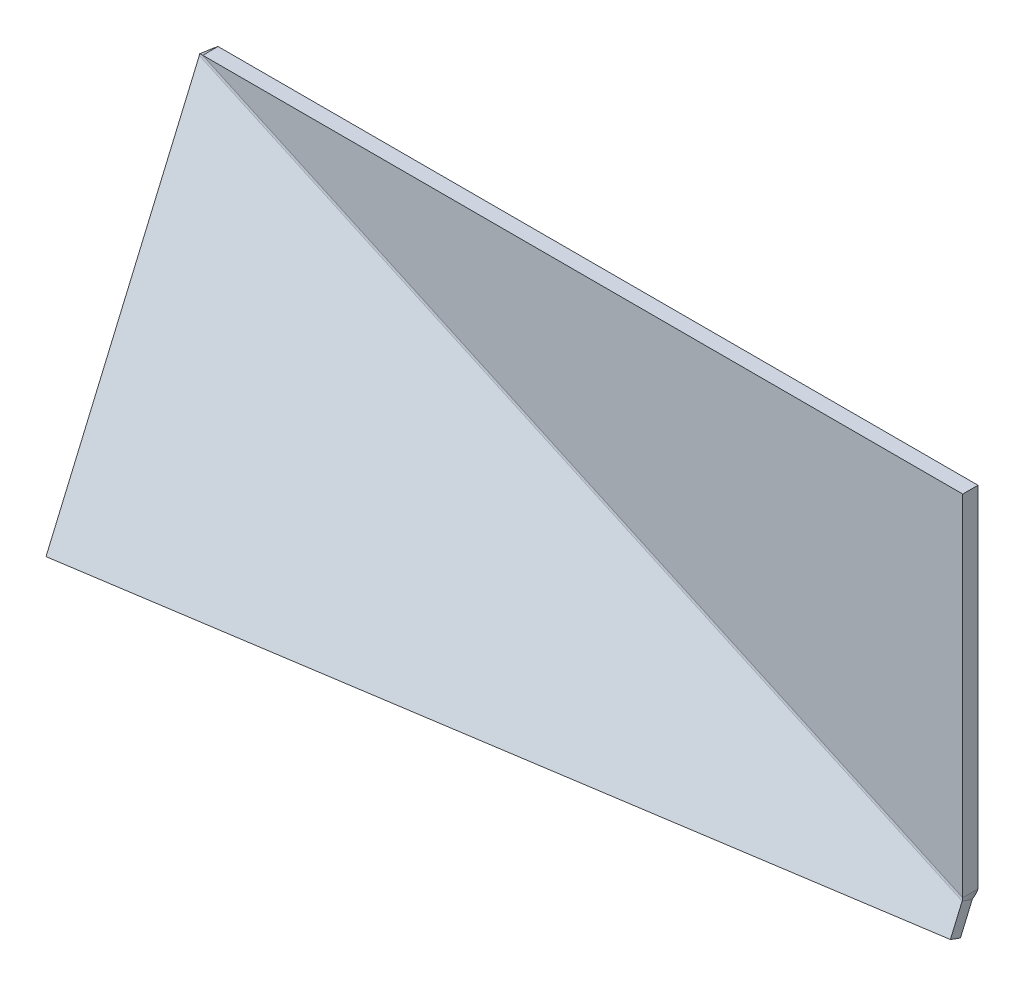
ISO-10303-21;
HEADER;
FILE_DESCRIPTION(('STEP AP214'),'2;1');
FILE_NAME('part.step','',(''),(''),'','','');
FILE_SCHEMA(('AUTOMOTIVE_DESIGN { 1 0 10303 214 1 1 1 1 }'));
ENDSEC;
DATA;
#1=APPLICATION_CONTEXT('core data for automotive mechanical design processes');
#2=APPLICATION_PROTOCOL_DEFINITION('international standard','automotive_design',2000,#1);
#3=PRODUCT_CONTEXT('',#1,'mechanical');
#4=PRODUCT('Part','Part','',(#3));
#5=PRODUCT_RELATED_PRODUCT_CATEGORY('part','',(#4));
#6=PRODUCT_DEFINITION_FORMATION('','',#4);
#7=PRODUCT_DEFINITION_CONTEXT('part definition',#1,'design');
#8=PRODUCT_DEFINITION('design','',#6,#7);
#9=PRODUCT_DEFINITION_SHAPE('','',#8);
#10=(LENGTH_UNIT() NAMED_UNIT(*) SI_UNIT(.MILLI.,.METRE.));
#11=(NAMED_UNIT(*) PLANE_ANGLE_UNIT() SI_UNIT($,.RADIAN.));
#12=(NAMED_UNIT(*) SI_UNIT($,.STERADIAN.) SOLID_ANGLE_UNIT());
#13=UNCERTAINTY_MEASURE_WITH_UNIT(LENGTH_MEASURE(1.E-05),#10,'distance_accuracy_value','');
#14=(GEOMETRIC_REPRESENTATION_CONTEXT(3) GLOBAL_UNCERTAINTY_ASSIGNED_CONTEXT((#13)) GLOBAL_UNIT_ASSIGNED_CONTEXT((#10,
#11,#12)) REPRESENTATION_CONTEXT('',''));
#15=CARTESIAN_POINT('',(0.,0.,0.));
#16=DIRECTION('',(0.,0.,1.));
#17=DIRECTION('',(1.,0.,0.));
#18=AXIS2_PLACEMENT_3D('',#15,#16,#17);
#19=CARTESIAN_POINT('',(-239.387607480562,-101.929581479492,104.910277253923));
#20=DIRECTION('',(-0.976601993595892,0.0508652313132691,0.208952804116068));
#21=DIRECTION('',(0.208952804116079,0.454245226339291,0.866025403784446));
#22=AXIS2_PLACEMENT_3D('',#19,#20,#21);
#23=PLANE('',#22);
#24=DIRECTION('',(0.0508652313132712,-0.889423410188534,0.454245226339287));
#25=VECTOR('',#24,1.);
#26=CARTESIAN_POINT('',(-237.298079439401,-97.3871292160992,113.570531291768));
#27=LINE('',#26,#25);
#28=CARTESIAN_POINT('',(-249.970413817987,124.199808797276,0.401923788645786));
#29=VERTEX_POINT('',#28);
#30=CARTESIAN_POINT('',(-237.298079439401,-97.3871292160992,113.570531291768));
#31=VERTEX_POINT('',#30);
#32=EDGE_CURVE('E95',#29,#31,#27,.T.);
#33=ORIENTED_EDGE('',*,*,#32,.F.);
#34=CARTESIAN_POINT('',(-252.059941859148,119.657356533884,-8.25833024919886));
#35=CARTESIAN_POINT('',(-249.970413817986,124.199808797276,0.40192378864512));
#36=B_SPLINE_CURVE_WITH_KNOTS('',1,(#34,#35),.UNSPECIFIED.,.F.,.F.,(2,2),(0.,1.),.UNSPECIFIED.);
#37=CARTESIAN_POINT('',(-252.059941859148,119.657356533883,-8.25833024919864));
#38=VERTEX_POINT('',#37);
#39=EDGE_CURVE('E136',#29,#38,#36,.F.);
#40=ORIENTED_EDGE('',*,*,#39,.T.);
#41=DIRECTION('',(0.0508652313132712,-0.889423410188534,0.454245226339287));
#42=VECTOR('',#41,1.);
#43=CARTESIAN_POINT('',(-239.387607480562,-101.929581479492,104.910277253923));
#44=LINE('',#43,#42);
#45=CARTESIAN_POINT('',(-239.387607480562,-101.929581479492,104.910277253923));
#46=VERTEX_POINT('',#45);
#47=EDGE_CURVE('E138',#38,#46,#44,.T.);
#48=ORIENTED_EDGE('',*,*,#47,.T.);
#49=DIRECTION('',(0.208952804116079,0.454245226339291,0.866025403784446));
#50=VECTOR('',#49,1.);
#51=CARTESIAN_POINT('',(-239.387607480562,-101.929581479492,104.910277253923));
#52=LINE('',#51,#50);
#53=EDGE_CURVE('E359',#46,#31,#52,.T.);
#54=ORIENTED_EDGE('',*,*,#53,.T.);
#55=EDGE_LOOP('',(#33,#40,#48,#54));
#56=FACE_BOUND('',#55,.T.);
#57=ADVANCED_FACE('F68',(#56),#23,.T.);
#58=CARTESIAN_POINT('',(248.913389317385,-127.362197136127,0.433875195888667));
#59=DIRECTION('',(0.976601993595892,-0.0508652313132691,-0.208952804116068));
#60=DIRECTION('',(-0.208952804116079,-0.454245226339291,-0.866025403784446));
#61=AXIS2_PLACEMENT_3D('',#58,#59,#60);
#62=PLANE('',#61);
#63=DIRECTION('',(-0.0508652313132712,0.889423410188534,-0.454245226339287));
#64=VECTOR('',#63,1.);
#65=CARTESIAN_POINT('',(248.913389317385,-127.362197136127,0.433875195888667));
#66=LINE('',#65,#64);
#67=CARTESIAN_POINT('',(248.913389317385,-127.362197136127,0.433875195888667));
#68=VERTEX_POINT('',#67);
#69=CARTESIAN_POINT('',(247.940058140852,-110.342643466115,-8.25833024919798));
#70=VERTEX_POINT('',#69);
#71=EDGE_CURVE('E353',#68,#70,#66,.T.);
#72=ORIENTED_EDGE('',*,*,#71,.T.);
#73=CARTESIAN_POINT('',(250.029586182009,-105.800191202722,0.401923788647118));
#74=CARTESIAN_POINT('',(247.94005814085,-110.342643466114,-8.25833024919642));
#75=B_SPLINE_CURVE_WITH_KNOTS('',1,(#73,#74),.UNSPECIFIED.,.F.,.F.,(2,2),(0.,1.),.UNSPECIFIED.);
#76=CARTESIAN_POINT('',(250.02958618201,-105.800191202721,0.401923788646674));
#77=VERTEX_POINT('',#76);
#78=EDGE_CURVE('E12',#70,#77,#75,.F.);
#79=ORIENTED_EDGE('',*,*,#78,.T.);
#80=DIRECTION('',(-0.0508652313132712,0.889423410188534,-0.454245226339287));
#81=VECTOR('',#80,1.);
#82=CARTESIAN_POINT('',(251.002917358542,-122.819744872734,9.0941292337342));
#83=LINE('',#82,#81);
#84=CARTESIAN_POINT('',(251.002917358542,-122.819744872734,9.0941292337342));
#85=VERTEX_POINT('',#84);
#86=EDGE_CURVE('E88',#85,#77,#83,.T.);
#87=ORIENTED_EDGE('',*,*,#86,.F.);
#88=DIRECTION('',(0.208952804116079,0.454245226339291,0.866025403784446));
#89=VECTOR('',#88,1.);
#90=CARTESIAN_POINT('',(248.913389317385,-127.362197136127,0.433875195888667));
#91=LINE('',#90,#89);
#92=EDGE_CURVE('E171',#68,#85,#91,.T.);
#93=ORIENTED_EDGE('',*,*,#92,.F.);
#94=EDGE_LOOP('',(#72,#79,#87,#93));
#95=FACE_BOUND('',#94,.T.);
#96=ADVANCED_FACE('F70',(#95),#62,.T.);
#97=CARTESIAN_POINT('',(0.494265045410724,1.07448922915021,4.55167697034009));
#98=DIRECTION('',(0.208952804116079,0.454245226339291,0.866025403784446));
#99=DIRECTION('',(0.976601993595892,-0.0508652313132691,-0.208952804116068));
#100=AXIS2_PLACEMENT_3D('',#97,#98,#99);
#101=PLANE('',#100);
#102=ORIENTED_EDGE('',*,*,#86,.T.);
#103=DIRECTION('',(-0.908490452678569,0.417905608232139,0.));
#104=VECTOR('',#103,1.);
#105=CARTESIAN_POINT('',(3.49799643683002,7.60434008006161,0.401923788644565));
#106=LINE('',#105,#104);
#107=EDGE_CURVE('E81',#77,#29,#106,.T.);
#108=ORIENTED_EDGE('',*,*,#107,.T.);
#109=ORIENTED_EDGE('',*,*,#32,.T.);
#110=DIRECTION('',(0.976601993595892,-0.0508652313132689,-0.208952804116068));
#111=VECTOR('',#110,1.);
#112=CARTESIAN_POINT('',(251.002917358542,-122.819744872734,9.0941292337342));
#113=LINE('',#112,#111);
#114=EDGE_CURVE('E354',#31,#85,#113,.T.);
#115=ORIENTED_EDGE('',*,*,#114,.T.);
#116=EDGE_LOOP('',(#102,#108,#109,#115));
#117=FACE_BOUND('',#116,.T.);
#118=ADVANCED_FACE('F392',(#117),#101,.T.);
#119=CARTESIAN_POINT('',(248.913389317385,-127.362197136127,0.433875195888667));
#120=DIRECTION('',(0.0508652313132713,-0.889423410188533,0.454245226339285));
#121=DIRECTION('',(0.976601993595892,-0.0508652313132689,-0.208952804116068));
#122=AXIS2_PLACEMENT_3D('',#119,#120,#121);
#123=PLANE('',#122);
#124=ORIENTED_EDGE('',*,*,#114,.F.);
#125=ORIENTED_EDGE('',*,*,#53,.F.);
#126=DIRECTION('',(0.976601993595892,-0.0508652313132689,-0.208952804116068));
#127=VECTOR('',#126,1.);
#128=CARTESIAN_POINT('',(248.913389317385,-127.362197136127,0.433875195888667));
#129=LINE('',#128,#127);
#130=EDGE_CURVE('E155',#46,#68,#129,.T.);
#131=ORIENTED_EDGE('',*,*,#130,.T.);
#132=ORIENTED_EDGE('',*,*,#92,.T.);
#133=EDGE_LOOP('',(#124,#125,#131,#132));
#134=FACE_BOUND('',#133,.T.);
#135=ADVANCED_FACE('F333',(#134),#123,.T.);
#136=CARTESIAN_POINT('',(-1.59526299575091,-3.46796303424235,-4.10857706750389));
#137=DIRECTION('',(0.208952804116079,0.454245226339291,0.866025403784446));
#138=DIRECTION('',(0.976601993595892,-0.0508652313132691,-0.208952804116068));
#139=AXIS2_PLACEMENT_3D('',#136,#137,#138);
#140=PLANE('',#139);
#141=DIRECTION('',(-0.908490452678569,0.417905608232139,0.));
#142=VECTOR('',#141,1.);
#143=CARTESIAN_POINT('',(1.40846839566888,3.06188781666838,-8.25833024919775));
#144=LINE('',#143,#142);
#145=EDGE_CURVE('E146',#70,#38,#144,.T.);
#146=ORIENTED_EDGE('',*,*,#145,.F.);
#147=ORIENTED_EDGE('',*,*,#71,.F.);
#148=ORIENTED_EDGE('',*,*,#130,.F.);
#149=ORIENTED_EDGE('',*,*,#47,.F.);
#150=EDGE_LOOP('',(#146,#147,#148,#149));
#151=FACE_BOUND('',#150,.T.);
#152=ADVANCED_FACE('F151',(#151),#140,.F.);
#153=CARTESIAN_POINT('',(1.77635683940025E-12,7.21644966006352E-13,-10.0000000000012));
#154=DIRECTION('',(0.,0.,1.));
#155=DIRECTION('',(0.999999999999997,0.,0.));
#156=AXIS2_PLACEMENT_3D('',#153,#154,#155);
#157=PLANE('',#156);
#158=DIRECTION('',(0.,0.999999999999993,0.));
#159=VECTOR('',#158,1.);
#160=CARTESIAN_POINT('',(249.999999999999,-125.,-9.99999999999956));
#161=LINE('',#160,#159);
#162=CARTESIAN_POINT('',(250.,-104.135491010299,-9.99999999999923));
#163=VERTEX_POINT('',#162);
#164=CARTESIAN_POINT('',(250.,125.,-9.99999999999968));
#165=VERTEX_POINT('',#164);
#166=EDGE_CURVE('E292',#163,#165,#161,.T.);
#167=ORIENTED_EDGE('',*,*,#166,.F.);
#168=DIRECTION('',(-0.908490452678569,0.41790560823214,0.));
#169=VECTOR('',#168,1.);
#170=CARTESIAN_POINT('',(4.1248548491809,8.96707575907896,-10.000000000001));
#171=LINE('',#170,#169);
#172=CARTESIAN_POINT('',(-248.120632631083,124.999999999999,-9.9999999999999));
#173=VERTEX_POINT('',#172);
#174=EDGE_CURVE('E297',#163,#173,#171,.T.);
#175=ORIENTED_EDGE('',*,*,#174,.T.);
#176=DIRECTION('',(-0.999999999999995,0.,0.));
#177=VECTOR('',#176,1.);
#178=CARTESIAN_POINT('',(250.,125.,-9.99999999999968));
#179=LINE('',#178,#177);
#180=EDGE_CURVE('E293',#165,#173,#179,.T.);
#181=ORIENTED_EDGE('',*,*,#180,.F.);
#182=EDGE_LOOP('',(#167,#175,#181));
#183=FACE_BOUND('',#182,.T.);
#184=ADVANCED_FACE('F324',(#183),#157,.F.);
#185=CARTESIAN_POINT('',(250.,125.,-9.99999999999968));
#186=DIRECTION('',(0.,0.999999999999994,0.));
#187=DIRECTION('',(-0.999999999999995,0.,0.));
#188=AXIS2_PLACEMENT_3D('',#185,#186,#187);
#189=PLANE('',#188);
#190=CARTESIAN_POINT('',(-248.120632631082,124.999999999999,-1.22124532708767E-12));
#191=CARTESIAN_POINT('',(-248.120632631083,124.999999999999,-9.9999999999999));
#192=B_SPLINE_CURVE_WITH_KNOTS('',1,(#190,#191),.UNSPECIFIED.,.F.,.F.,(2,2),(0.,1.),.UNSPECIFIED.);
#193=CARTESIAN_POINT('',(-248.120632631082,124.999999999998,-4.44089209850063E-13));
#194=VERTEX_POINT('',#193);
#195=EDGE_CURVE('E279',#194,#173,#192,.T.);
#196=ORIENTED_EDGE('',*,*,#195,.F.);
#197=DIRECTION('',(-0.999999999999995,0.,0.));
#198=VECTOR('',#197,1.);
#199=CARTESIAN_POINT('',(250.000000000001,125.,5.55111512312578E-13));
#200=LINE('',#199,#198);
#201=CARTESIAN_POINT('',(250.000000000001,125.,5.55111512312578E-13));
#202=VERTEX_POINT('',#201);
#203=EDGE_CURVE('E348',#202,#194,#200,.T.);
#204=ORIENTED_EDGE('',*,*,#203,.F.);
#205=DIRECTION('',(0.,0.,1.));
#206=VECTOR('',#205,1.);
#207=CARTESIAN_POINT('',(250.,125.,-9.99999999999968));
#208=LINE('',#207,#206);
#209=EDGE_CURVE('E283',#165,#202,#208,.T.);
#210=ORIENTED_EDGE('',*,*,#209,.F.);
#211=ORIENTED_EDGE('',*,*,#180,.T.);
#212=EDGE_LOOP('',(#196,#204,#210,#211));
#213=FACE_BOUND('',#212,.T.);
#214=ADVANCED_FACE('F314',(#213),#189,.T.);
#215=CARTESIAN_POINT('',(0.,0.,0.));
#216=DIRECTION('',(0.,0.,1.));
#217=DIRECTION('',(0.999999999999997,0.,0.));
#218=AXIS2_PLACEMENT_3D('',#215,#216,#217);
#219=PLANE('',#218);
#220=DIRECTION('',(-0.908490452678569,0.41790560823214,0.));
#221=VECTOR('',#220,1.);
#222=CARTESIAN_POINT('',(4.12485484917802,8.9670757590794,-1.11022302462516E-13));
#223=LINE('',#222,#221);
#224=CARTESIAN_POINT('',(250.,-104.135491010299,4.44089209850063E-13));
#225=VERTEX_POINT('',#224);
#226=EDGE_CURVE('E312',#225,#194,#223,.T.);
#227=ORIENTED_EDGE('',*,*,#226,.F.);
#228=DIRECTION('',(0.,0.999999999999993,0.));
#229=VECTOR('',#228,1.);
#230=CARTESIAN_POINT('',(249.999999999999,-124.999999999998,3.33066907387547E-13));
#231=LINE('',#230,#229);
#232=EDGE_CURVE('E296',#225,#202,#231,.T.);
#233=ORIENTED_EDGE('',*,*,#232,.T.);
#234=ORIENTED_EDGE('',*,*,#203,.T.);
#235=EDGE_LOOP('',(#227,#233,#234));
#236=FACE_BOUND('',#235,.T.);
#237=ADVANCED_FACE('F323',(#236),#219,.T.);
#238=CARTESIAN_POINT('',(249.999999999999,-125.,-9.99999999999956));
#239=DIRECTION('',(0.999999999999997,0.,0.));
#240=DIRECTION('',(0.,0.,-1.));
#241=AXIS2_PLACEMENT_3D('',#238,#239,#240);
#242=PLANE('',#241);
#243=CARTESIAN_POINT('',(250.,-104.135491010299,-9.9999999999999));
#244=CARTESIAN_POINT('',(250.,-104.135491010299,4.44089209850063E-13));
#245=B_SPLINE_CURVE_WITH_KNOTS('',1,(#243,#244),.UNSPECIFIED.,.F.,.F.,(2,2),(0.,1.),.UNSPECIFIED.);
#246=EDGE_CURVE('E266',#163,#225,#245,.T.);
#247=ORIENTED_EDGE('',*,*,#246,.F.);
#248=ORIENTED_EDGE('',*,*,#166,.T.);
#249=ORIENTED_EDGE('',*,*,#209,.T.);
#250=ORIENTED_EDGE('',*,*,#232,.F.);
#251=EDGE_LOOP('',(#247,#248,#249,#250));
#252=FACE_BOUND('',#251,.T.);
#253=ADVANCED_FACE('F327',(#252),#242,.T.);
#254=CARTESIAN_POINT('',(250.,-104.135491010299,-9.9999999999999));
#255=CARTESIAN_POINT('',(249.269445747172,-106.300917342137,-9.9999999999999));
#256=CARTESIAN_POINT('',(248.54337396933,-108.453822404596,-9.39461618311133));
#257=CARTESIAN_POINT('',(247.94005814085,-110.342643466114,-8.25833024919642));
#258=CARTESIAN_POINT('',(250.,-104.135491010299,4.44089209850063E-13));
#259=CARTESIAN_POINT('',(250.,-104.712641165431,3.33066907387547E-13));
#260=CARTESIAN_POINT('',(250.000229305867,-105.286860343554,0.139756085797638));
#261=CARTESIAN_POINT('',(250.029586182009,-105.800191202722,0.401923788647118));
#262=B_SPLINE_SURFACE_WITH_KNOTS('',1,3,((#254,#255,#256,#257),(#258,#259,#260,#261)),
.UNSPECIFIED.,.F.,.F.,.F.,(2,2),(4,4),(0.,1.),(0.,1.),.UNSPECIFIED.);
#263=CARTESIAN_POINT('',(250.,-104.135491010299,4.44089209850063E-13));
#264=CARTESIAN_POINT('',(250.,-104.712641165431,3.33066907387547E-13));
#265=CARTESIAN_POINT('',(250.000229305867,-105.286860343554,0.139756085797638));
#266=CARTESIAN_POINT('',(250.029586182009,-105.800191202722,0.401923788647118));
#267=B_SPLINE_CURVE_WITH_KNOTS('',3,(#263,#264,#265,#266),.UNSPECIFIED.,.F.,.F.,(4,4),(0.,1.),.UNSPECIFIED.);
#268=EDGE_CURVE('E578',#225,#77,#267,.T.);
#269=CARTESIAN_POINT('',(247.94005814085,-110.342643466114,-8.25833024919642));
#270=CARTESIAN_POINT('',(248.54337396933,-108.453822404596,-9.39461618311133));
#271=CARTESIAN_POINT('',(249.269445747172,-106.300917342137,-9.9999999999999));
#272=CARTESIAN_POINT('',(250.,-104.135491010299,-9.9999999999999));
#273=B_SPLINE_CURVE_WITH_KNOTS('',3,(#269,#270,#271,#272),.UNSPECIFIED.,.F.,.F.,(4,4),(0.,1.),.UNSPECIFIED.);
#274=EDGE_CURVE('E168',#163,#70,#273,.F.);
#275=ORIENTED_EDGE('',*,*,#246,.T.);
#276=ORIENTED_EDGE('',*,*,#268,.T.);
#277=ORIENTED_EDGE('',*,*,#78,.F.);
#278=ORIENTED_EDGE('',*,*,#274,.F.);
#279=EDGE_LOOP('',(#275,#276,#277,#278));
#280=FACE_BOUND('',#279,.T.);
#281=ADVANCED_FACE('F202',(#280),#262,.T.);
#282=CARTESIAN_POINT('',(-252.059941859148,119.657356533884,-8.25833024919886));
#283=CARTESIAN_POINT('',(-251.75872875762,120.600374474592,-8.82563545522796));
#284=CARTESIAN_POINT('',(-251.426464690165,121.610782953551,-9.26337695834645));
#285=CARTESIAN_POINT('',(-251.077882798872,122.656776524184,-9.55703574175815));
#286=CARTESIAN_POINT('',(-249.970413817986,124.199808797276,0.40192378864512));
#287=CARTESIAN_POINT('',(-249.985073237806,124.456141675944,0.271009777214393));
#288=CARTESIAN_POINT('',(-249.992535118599,124.728026820413,0.169988599989956));
#289=CARTESIAN_POINT('',(-249.996263494216,125.008122838656,0.102222521132345));
#290=B_SPLINE_SURFACE_WITH_KNOTS('',1,3,((#282,#283,#284,#285),(#286,#287,#288,#289)),
.UNSPECIFIED.,.F.,.F.,.F.,(2,2),(4,4),(0.,1.),(0.,1.),.UNSPECIFIED.);
#291=CARTESIAN_POINT('',(-249.970413817986,124.199808797276,0.40192378864512));
#292=CARTESIAN_POINT('',(-249.985073237806,124.456141675944,0.271009777214393));
#293=CARTESIAN_POINT('',(-249.992535118599,124.728026820413,0.169988599989956));
#294=CARTESIAN_POINT('',(-249.996263494216,125.008122838656,0.102222521132345));
#295=B_SPLINE_CURVE_WITH_KNOTS('',3,(#291,#292,#293,#294),.UNSPECIFIED.,.F.,.F.,(4,4),(0.,1.),.UNSPECIFIED.);
#296=CARTESIAN_POINT('',(-249.996263494216,125.008122838656,0.102222521132345));
#297=VERTEX_POINT('',#296);
#298=EDGE_CURVE('E588',#29,#297,#295,.T.);
#299=CARTESIAN_POINT('',(-249.996263494216,125.008122838656,0.102222521132345));
#300=CARTESIAN_POINT('',(-251.077882798872,122.656776524184,-9.55703574175815));
#301=B_SPLINE_CURVE_WITH_KNOTS('',1,(#299,#300),.UNSPECIFIED.,.F.,.F.,(2,2),(0.,1.),.UNSPECIFIED.);
#302=CARTESIAN_POINT('',(-251.077882798872,122.656776524184,-9.55703574175815));
#303=VERTEX_POINT('',#302);
#304=EDGE_CURVE('E175',#297,#303,#301,.T.);
#305=CARTESIAN_POINT('',(-251.077882798872,122.656776524184,-9.55703574175815));
#306=CARTESIAN_POINT('',(-251.426464690165,121.610782953551,-9.26337695834645));
#307=CARTESIAN_POINT('',(-251.75872875762,120.600374474592,-8.82563545522796));
#308=CARTESIAN_POINT('',(-252.059941859148,119.657356533884,-8.25833024919886));
#309=B_SPLINE_CURVE_WITH_KNOTS('',3,(#305,#306,#307,#308),.UNSPECIFIED.,.F.,.F.,(4,4),(0.,1.),.UNSPECIFIED.);
#310=EDGE_CURVE('E163',#38,#303,#309,.F.);
#311=ORIENTED_EDGE('',*,*,#39,.F.);
#312=ORIENTED_EDGE('',*,*,#298,.T.);
#313=ORIENTED_EDGE('',*,*,#304,.T.);
#314=ORIENTED_EDGE('',*,*,#310,.F.);
#315=EDGE_LOOP('',(#311,#312,#313,#314));
#316=FACE_BOUND('',#315,.T.);
#317=ADVANCED_FACE('F174',(#316),#290,.T.);
#318=CARTESIAN_POINT('',(-251.077882798872,122.656776524184,-9.55703574175815));
#319=CARTESIAN_POINT('',(-250.102786607917,123.414545889907,-9.85068779993503));
#320=CARTESIAN_POINT('',(-249.111885064083,124.207108368955,-10.0000000000021));
#321=CARTESIAN_POINT('',(-248.120632631083,124.999999999999,-9.9999999999999));
#322=CARTESIAN_POINT('',(-249.996263494216,125.008122838656,0.102222521132345));
#323=CARTESIAN_POINT('',(-249.373520312707,125.000018360813,0.0344621822898628));
#324=CARTESIAN_POINT('',(-248.747103872397,124.999999999999,-5.55111512312578E-13));
#325=CARTESIAN_POINT('',(-248.120632631082,124.999999999999,-1.22124532708767E-12));
#326=B_SPLINE_SURFACE_WITH_KNOTS('',1,3,((#318,#319,#320,#321),(#322,#323,#324,#325)),
.UNSPECIFIED.,.F.,.F.,.F.,(2,2),(4,4),(0.,1.),(0.,1.),.UNSPECIFIED.);
#327=CARTESIAN_POINT('',(-249.996263494216,125.008122838656,0.102222521132345));
#328=CARTESIAN_POINT('',(-249.373520312707,125.000018360813,0.0344621822898628));
#329=CARTESIAN_POINT('',(-248.747103872397,124.999999999999,-5.55111512312578E-13));
#330=CARTESIAN_POINT('',(-248.120632631082,124.999999999999,-1.22124532708767E-12));
#331=B_SPLINE_CURVE_WITH_KNOTS('',3,(#327,#328,#329,#330),.UNSPECIFIED.,.F.,.F.,(4,4),(0.,1.),.UNSPECIFIED.);
#332=EDGE_CURVE('E591',#297,#194,#331,.T.);
#333=CARTESIAN_POINT('',(-248.120632631083,124.999999999999,-9.9999999999999));
#334=CARTESIAN_POINT('',(-249.111885064083,124.207108368955,-10.0000000000021));
#335=CARTESIAN_POINT('',(-250.102786607917,123.414545889907,-9.85068779993503));
#336=CARTESIAN_POINT('',(-251.077882798872,122.656776524184,-9.55703574175815));
#337=B_SPLINE_CURVE_WITH_KNOTS('',3,(#333,#334,#335,#336),.UNSPECIFIED.,.F.,.F.,(4,4),(0.,1.),.UNSPECIFIED.);
#338=EDGE_CURVE('E178',#303,#173,#337,.F.);
#339=ORIENTED_EDGE('',*,*,#304,.F.);
#340=ORIENTED_EDGE('',*,*,#332,.T.);
#341=ORIENTED_EDGE('',*,*,#195,.T.);
#342=ORIENTED_EDGE('',*,*,#338,.F.);
#343=EDGE_LOOP('',(#339,#340,#341,#342));
#344=FACE_BOUND('',#343,.T.);
#345=ADVANCED_FACE('F201',(#344),#326,.T.);
#346=CARTESIAN_POINT('',(501.350889232168,-219.756900057095,3.00000000000111));
#347=DIRECTION('',(-0.908490452678569,0.417905608232139,0.));
#348=DIRECTION('',(-0.417905608232146,-0.908490452678571,0.));
#349=AXIS2_PLACEMENT_3D('',#346,#347,#348);
#350=CYLINDRICAL_SURFACE('',#349,13.);
#351=ORIENTED_EDGE('',*,*,#338,.T.);
#352=ORIENTED_EDGE('',*,*,#174,.F.);
#353=ORIENTED_EDGE('',*,*,#274,.T.);
#354=ORIENTED_EDGE('',*,*,#145,.T.);
#355=ORIENTED_EDGE('',*,*,#310,.T.);
#356=EDGE_LOOP('',(#351,#352,#353,#354,#355));
#357=FACE_BOUND('',#356,.T.);
#358=ADVANCED_FACE('F162',(#357),#350,.T.);
#359=CARTESIAN_POINT('',(501.350889232168,-219.756900057095,3.00000000000111));
#360=DIRECTION('',(-0.908490452678569,0.417905608232139,0.));
#361=DIRECTION('',(-0.417905608232146,-0.908490452678571,0.));
#362=AXIS2_PLACEMENT_3D('',#359,#360,#361);
#363=CYLINDRICAL_SURFACE('',#362,3.);
#364=ORIENTED_EDGE('',*,*,#332,.F.);
#365=ORIENTED_EDGE('',*,*,#298,.F.);
#366=ORIENTED_EDGE('',*,*,#107,.F.);
#367=ORIENTED_EDGE('',*,*,#268,.F.);
#368=ORIENTED_EDGE('',*,*,#226,.T.);
#369=EDGE_LOOP('',(#364,#365,#366,#367,#368));
#370=FACE_BOUND('',#369,.T.);
#371=ADVANCED_FACE('F487',(#370),#363,.F.);
#372=CLOSED_SHELL('',(#57,#96,#118,#135,#152,#184,#214,#237,#253,#281,#317,#345,#358,#371));
#373=MANIFOLD_SOLID_BREP('B2',#372);
#374=ADVANCED_BREP_SHAPE_REPRESENTATION('',(#18,#373),#14);
#375=SHAPE_DEFINITION_REPRESENTATION(#9,#374);
ENDSEC;
END-ISO-10303-21;
